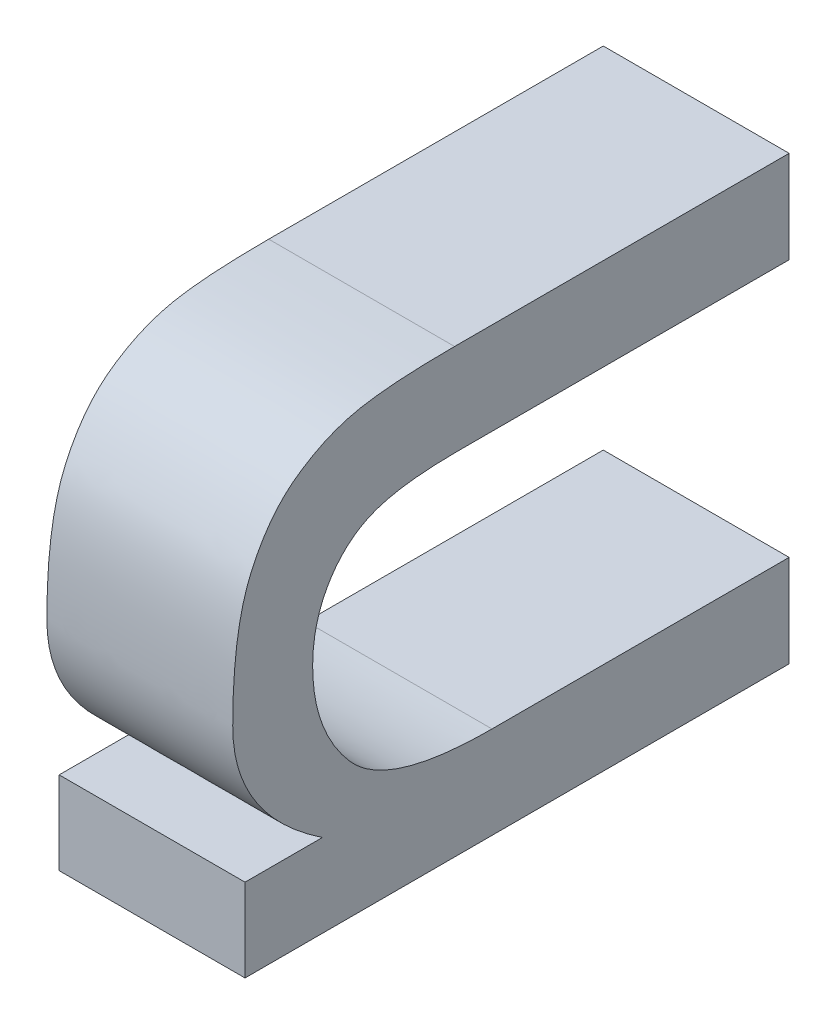
ISO-10303-21;
HEADER;
FILE_DESCRIPTION(('STEP AP214'),'2;1');
FILE_NAME('part.step','',(''),(''),'','','');
FILE_SCHEMA(('AUTOMOTIVE_DESIGN { 1 0 10303 214 1 1 1 1 }'));
ENDSEC;
DATA;
#1=APPLICATION_CONTEXT('core data for automotive mechanical design processes');
#2=APPLICATION_PROTOCOL_DEFINITION('international standard','automotive_design',2000,#1);
#3=PRODUCT_CONTEXT('',#1,'mechanical');
#4=PRODUCT('Part','Part','',(#3));
#5=PRODUCT_RELATED_PRODUCT_CATEGORY('part','',(#4));
#6=PRODUCT_DEFINITION_FORMATION('','',#4);
#7=PRODUCT_DEFINITION_CONTEXT('part definition',#1,'design');
#8=PRODUCT_DEFINITION('design','',#6,#7);
#9=PRODUCT_DEFINITION_SHAPE('','',#8);
#10=(LENGTH_UNIT() NAMED_UNIT(*) SI_UNIT(.MILLI.,.METRE.));
#11=(NAMED_UNIT(*) PLANE_ANGLE_UNIT() SI_UNIT($,.RADIAN.));
#12=(NAMED_UNIT(*) SI_UNIT($,.STERADIAN.) SOLID_ANGLE_UNIT());
#13=UNCERTAINTY_MEASURE_WITH_UNIT(LENGTH_MEASURE(1.E-05),#10,'distance_accuracy_value','');
#14=(GEOMETRIC_REPRESENTATION_CONTEXT(3) GLOBAL_UNCERTAINTY_ASSIGNED_CONTEXT((#13)) GLOBAL_UNIT_ASSIGNED_CONTEXT((#10,
#11,#12)) REPRESENTATION_CONTEXT('',''));
#15=CARTESIAN_POINT('',(0.,0.,0.));
#16=DIRECTION('',(0.,0.,1.));
#17=DIRECTION('',(1.,0.,0.));
#18=AXIS2_PLACEMENT_3D('',#15,#16,#17);
#19=CARTESIAN_POINT('',(4.55229940712901,-38.455317313085,-8.87538537038162));
#20=DIRECTION('',(-1.,0.,0.));
#21=DIRECTION('',(0.,0.,1.));
#22=AXIS2_PLACEMENT_3D('',#19,#20,#21);
#23=PLANE('',#22);
#24=CARTESIAN_POINT('',(4.552299407129,-38.3809253093449,-8.96104471327083));
#25=CARTESIAN_POINT('',(4.55229940712899,-38.3486738431566,-8.91280534076686));
#26=CARTESIAN_POINT('',(4.55229940712898,-38.2612916655351,-8.91280534076686));
#27=CARTESIAN_POINT('',(4.55229940712897,-38.2169114428315,-8.93182543621128));
#28=CARTESIAN_POINT('',(4.55229940712897,-38.1948591582582,-8.96269863461382));
#29=CARTESIAN_POINT('',(4.55229940712897,-38.1876921657719,-8.99770663637385));
#30=CARTESIAN_POINT('',(4.55229940712897,-38.1876921657719,-9.03216333101953));
#31=(BOUNDED_CURVE() B_SPLINE_CURVE(2,(#24,#25,#26,#27,#28,#29,#30),.UNSPECIFIED.,.F.,
.F.) B_SPLINE_CURVE_WITH_KNOTS((3,1,1,1,1,3),(16.6383776414451,17.6383776414451,
18.6383776414451,19.6383776414451,20.6383776414451,21.6383776414451),
.UNSPECIFIED.) CURVE() GEOMETRIC_REPRESENTATION_ITEM() RATIONAL_B_SPLINE_CURVE((1.,1.,1.,1.,1.,
1.,1.)) REPRESENTATION_ITEM(''));
#32=CARTESIAN_POINT('',(4.552299407129,-38.3809253093449,-8.96104471327083));
#33=VERTEX_POINT('',#32);
#34=CARTESIAN_POINT('',(4.55229940712897,-38.1876921657719,-9.03216333101953));
#35=VERTEX_POINT('',#34);
#36=EDGE_CURVE('E270',#33,#35,#31,.T.);
#37=ORIENTED_EDGE('',*,*,#36,.T.);
#38=CARTESIAN_POINT('',(4.55229940712897,-38.1876921657719,-9.03216333101953));
#39=CARTESIAN_POINT('',(4.55229940712897,-38.1876921657719,-9.12216421743409));
#40=CARTESIAN_POINT('',(4.55229940712897,-38.1876921657719,-9.21216510384864));
#41=(BOUNDED_CURVE() B_SPLINE_CURVE(2,(#38,#39,#40),.UNSPECIFIED.,.F.,
.F.) B_SPLINE_CURVE_WITH_KNOTS((3,3),(21.6383776414451,22.6383776414451),
.UNSPECIFIED.) CURVE() GEOMETRIC_REPRESENTATION_ITEM() RATIONAL_B_SPLINE_CURVE((1.,1.,1.)) REPRESENTATION_ITEM(''));
#42=CARTESIAN_POINT('',(4.55229940712897,-38.1876921657719,-9.21216510384864));
#43=VERTEX_POINT('',#42);
#44=EDGE_CURVE('E103',#35,#43,#41,.T.);
#45=ORIENTED_EDGE('',*,*,#44,.T.);
#46=CARTESIAN_POINT('',(4.55229940712897,-38.1876921657719,-9.21216510384864));
#47=CARTESIAN_POINT('',(4.55229940712898,-38.2125009859168,-9.21216510384864));
#48=CARTESIAN_POINT('',(4.55229940712898,-38.2373098060617,-9.21216510384864));
#49=(BOUNDED_CURVE() B_SPLINE_CURVE(2,(#46,#47,#48),.UNSPECIFIED.,.F.,
.F.) B_SPLINE_CURVE_WITH_KNOTS((3,3),(22.6383776414451,23.6383776414451),
.UNSPECIFIED.) CURVE() GEOMETRIC_REPRESENTATION_ITEM() RATIONAL_B_SPLINE_CURVE((1.,1.,1.)) REPRESENTATION_ITEM(''));
#50=CARTESIAN_POINT('',(4.55229940712898,-38.2373098060617,-9.21216510384864));
#51=VERTEX_POINT('',#50);
#52=EDGE_CURVE('E177',#43,#51,#49,.T.);
#53=ORIENTED_EDGE('',*,*,#52,.T.);
#54=CARTESIAN_POINT('',(4.55229940712898,-38.2373098060617,-9.21216510384864));
#55=CARTESIAN_POINT('',(4.55229940712898,-38.2373098060617,-9.12312900488417));
#56=CARTESIAN_POINT('',(4.55229940712898,-38.2373098060617,-9.0340929059197));
#57=(BOUNDED_CURVE() B_SPLINE_CURVE(2,(#54,#55,#56),.UNSPECIFIED.,.F.,
.F.) B_SPLINE_CURVE_WITH_KNOTS((3,3),(23.6383776414451,24.6383776414451),
.UNSPECIFIED.) CURVE() GEOMETRIC_REPRESENTATION_ITEM() RATIONAL_B_SPLINE_CURVE((1.,1.,1.)) REPRESENTATION_ITEM(''));
#58=CARTESIAN_POINT('',(4.55229940712898,-38.2373098060617,-9.0340929059197));
#59=VERTEX_POINT('',#58);
#60=EDGE_CURVE('E148',#51,#59,#57,.T.);
#61=ORIENTED_EDGE('',*,*,#60,.T.);
#62=CARTESIAN_POINT('',(4.55229940712898,-38.2373098060617,-9.0340929059197));
#63=CARTESIAN_POINT('',(4.55229940712898,-38.2373098060617,-9.00377101463148));
#64=CARTESIAN_POINT('',(4.55229940712898,-38.2430985307622,-8.98874789576596));
#65=CARTESIAN_POINT('',(4.55229940712898,-38.2488872554626,-8.97372477690045));
#66=CARTESIAN_POINT('',(4.55229940712898,-38.263634720771,-8.96476603629256));
#67=CARTESIAN_POINT('',(4.55229940712898,-38.2783821860794,-8.95580729568469));
#68=CARTESIAN_POINT('',(4.55229940712898,-38.2982292421953,-8.95580729568469));
#69=CARTESIAN_POINT('',(4.55229940712899,-38.3299294012693,-8.95580729568469));
#70=CARTESIAN_POINT('',(4.55229940712899,-38.3529464732926,-8.97593000535777));
#71=CARTESIAN_POINT('',(4.552299407129,-38.375963545316,-8.99605271503085));
#72=CARTESIAN_POINT('',(4.552299407129,-38.375963545316,-9.05228604069263));
#73=(BOUNDED_CURVE() B_SPLINE_CURVE(2,(#62,#63,#64,#65,#66,#67,#68,#69,#70,#71,#72),
.UNSPECIFIED.,.F.,.F.) B_SPLINE_CURVE_WITH_KNOTS((3,2,2,2,2,3),(24.6383776414451,
25.6383776414451,26.6383776414451,27.6383776414451,28.6383776414451,29.6383776414451),
.UNSPECIFIED.) CURVE() GEOMETRIC_REPRESENTATION_ITEM() RATIONAL_B_SPLINE_CURVE((1.,1.,1.,1.,1.,
1.,1.,1.,1.,1.,1.)) REPRESENTATION_ITEM(''));
#74=CARTESIAN_POINT('',(4.552299407129,-38.375963545316,-9.05228604069263));
#75=VERTEX_POINT('',#74);
#76=EDGE_CURVE('E145',#59,#75,#73,.T.);
#77=ORIENTED_EDGE('',*,*,#76,.T.);
#78=CARTESIAN_POINT('',(4.552299407129,-38.375963545316,-9.05228604069263));
#79=CARTESIAN_POINT('',(4.552299407129,-38.375963545316,-9.13222557227063));
#80=CARTESIAN_POINT('',(4.552299407129,-38.375963545316,-9.21216510384864));
#81=(BOUNDED_CURVE() B_SPLINE_CURVE(2,(#78,#79,#80),.UNSPECIFIED.,.F.,
.F.) B_SPLINE_CURVE_WITH_KNOTS((3,3),(29.6383776414451,30.6267893660532),
.UNSPECIFIED.) CURVE() GEOMETRIC_REPRESENTATION_ITEM() RATIONAL_B_SPLINE_CURVE((1.,1.,1.)) REPRESENTATION_ITEM(''));
#82=CARTESIAN_POINT('',(4.552299407129,-38.375963545316,-9.21216510384864));
#83=VERTEX_POINT('',#82);
#84=EDGE_CURVE('E131',#75,#83,#81,.T.);
#85=ORIENTED_EDGE('',*,*,#84,.T.);
#86=CARTESIAN_POINT('',(4.552299407129,-38.375963545316,-9.21216510384864));
#87=CARTESIAN_POINT('',(4.552299407129,-38.4007723654609,-9.21216510384864));
#88=CARTESIAN_POINT('',(4.55229940712901,-38.4255811856058,-9.21216510384864));
#89=(BOUNDED_CURVE() B_SPLINE_CURVE(2,(#86,#87,#88),.UNSPECIFIED.,.F.,
.F.) B_SPLINE_CURVE_WITH_KNOTS((3,3),(30.6267893660532,30.9335378323108),
.UNSPECIFIED.) CURVE() GEOMETRIC_REPRESENTATION_ITEM() RATIONAL_B_SPLINE_CURVE((1.,1.,1.)) REPRESENTATION_ITEM(''));
#90=CARTESIAN_POINT('',(4.55229940712901,-38.4255811856058,-9.21216510384864));
#91=VERTEX_POINT('',#90);
#92=EDGE_CURVE('E187',#83,#91,#89,.T.);
#93=ORIENTED_EDGE('',*,*,#92,.T.);
#94=CARTESIAN_POINT('',(4.55229940712901,-38.4255811856058,-9.21216510384864));
#95=CARTESIAN_POINT('',(4.552299407129,-38.4255811856058,-9.06579306499374));
#96=CARTESIAN_POINT('',(4.552299407129,-38.4255811856058,-8.91942102613884));
#97=(BOUNDED_CURVE() B_SPLINE_CURVE(2,(#94,#95,#96),.UNSPECIFIED.,.F.,
.F.) B_SPLINE_CURVE_WITH_KNOTS((3,3),(30.9335378323108,32.7433537832311),
.UNSPECIFIED.) CURVE() GEOMETRIC_REPRESENTATION_ITEM() RATIONAL_B_SPLINE_CURVE((1.,1.,1.)) REPRESENTATION_ITEM(''));
#98=CARTESIAN_POINT('',(4.552299407129,-38.4255811856058,-8.91942102613884));
#99=VERTEX_POINT('',#98);
#100=EDGE_CURVE('E300',#91,#99,#97,.T.);
#101=ORIENTED_EDGE('',*,*,#100,.T.);
#102=CARTESIAN_POINT('',(4.552299407129,-38.4255811856058,-8.91942102613884));
#103=CARTESIAN_POINT('',(4.552299407129,-38.4032532474753,-8.91942102613884));
#104=CARTESIAN_POINT('',(4.552299407129,-38.3809253093449,-8.91942102613884));
#105=(BOUNDED_CURVE() B_SPLINE_CURVE(2,(#102,#103,#104),.UNSPECIFIED.,.F.,
.F.) B_SPLINE_CURVE_WITH_KNOTS((3,3),(32.7433537832311,33.019427402863),
.UNSPECIFIED.) CURVE() GEOMETRIC_REPRESENTATION_ITEM() RATIONAL_B_SPLINE_CURVE((1.,1.,1.)) REPRESENTATION_ITEM(''));
#106=CARTESIAN_POINT('',(4.552299407129,-38.3809253093449,-8.91942102613884));
#107=VERTEX_POINT('',#106);
#108=EDGE_CURVE('E246',#99,#107,#105,.T.);
#109=ORIENTED_EDGE('',*,*,#108,.T.);
#110=CARTESIAN_POINT('',(4.552299407129,-38.3809253093449,-8.91942102613884));
#111=CARTESIAN_POINT('',(4.552299407129,-38.3809253093449,-8.94023286970483));
#112=CARTESIAN_POINT('',(4.552299407129,-38.3809253093449,-8.96104471327083));
#113=(BOUNDED_CURVE() B_SPLINE_CURVE(2,(#110,#111,#112),.UNSPECIFIED.,.F.,
.F.) B_SPLINE_CURVE_WITH_KNOTS((3,3),(33.019427402863,33.2767552828903),
.UNSPECIFIED.) CURVE() GEOMETRIC_REPRESENTATION_ITEM() RATIONAL_B_SPLINE_CURVE((1.,1.,1.)) REPRESENTATION_ITEM(''));
#114=EDGE_CURVE('E11',#107,#33,#113,.T.);
#115=ORIENTED_EDGE('',*,*,#114,.T.);
#116=EDGE_LOOP('',(#37,#45,#53,#61,#77,#85,#93,#101,#109,#115));
#117=FACE_BOUND('',#116,.T.);
#118=ADVANCED_FACE('F16',(#117),#23,.T.);
#119=CARTESIAN_POINT('',(4.65229940712901,-38.455317313085,-8.87538537038163));
#120=DIRECTION('',(1.,0.,0.));
#121=DIRECTION('',(0.,1.,0.));
#122=AXIS2_PLACEMENT_3D('',#119,#120,#121);
#123=PLANE('',#122);
#124=CARTESIAN_POINT('',(4.652299407129,-38.3809253093449,-8.91942102613884));
#125=CARTESIAN_POINT('',(4.652299407129,-38.3809253093449,-8.94023286970484));
#126=CARTESIAN_POINT('',(4.652299407129,-38.3809253093449,-8.96104471327083));
#127=(BOUNDED_CURVE() B_SPLINE_CURVE(2,(#124,#125,#126),.UNSPECIFIED.,.F.,
.F.) B_SPLINE_CURVE_WITH_KNOTS((3,3),(33.019427402863,33.2767552828903),
.UNSPECIFIED.) CURVE() GEOMETRIC_REPRESENTATION_ITEM() RATIONAL_B_SPLINE_CURVE((1.,1.,1.)) REPRESENTATION_ITEM(''));
#128=CARTESIAN_POINT('',(4.652299407129,-38.3809253093449,-8.91942102613884));
#129=VERTEX_POINT('',#128);
#130=CARTESIAN_POINT('',(4.652299407129,-38.3809253093449,-8.96104471327083));
#131=VERTEX_POINT('',#130);
#132=EDGE_CURVE('E31',#129,#131,#127,.T.);
#133=ORIENTED_EDGE('',*,*,#132,.F.);
#134=CARTESIAN_POINT('',(4.652299407129,-38.4255811856058,-8.91942102613884));
#135=CARTESIAN_POINT('',(4.652299407129,-38.4032532474753,-8.91942102613884));
#136=CARTESIAN_POINT('',(4.652299407129,-38.3809253093449,-8.91942102613884));
#137=(BOUNDED_CURVE() B_SPLINE_CURVE(2,(#134,#135,#136),.UNSPECIFIED.,.F.,
.F.) B_SPLINE_CURVE_WITH_KNOTS((3,3),(32.7433537832311,33.019427402863),
.UNSPECIFIED.) CURVE() GEOMETRIC_REPRESENTATION_ITEM() RATIONAL_B_SPLINE_CURVE((1.,1.,1.)) REPRESENTATION_ITEM(''));
#138=CARTESIAN_POINT('',(4.652299407129,-38.4255811856058,-8.91942102613884));
#139=VERTEX_POINT('',#138);
#140=EDGE_CURVE('E167',#139,#129,#137,.T.);
#141=ORIENTED_EDGE('',*,*,#140,.F.);
#142=CARTESIAN_POINT('',(4.65229940712901,-38.4255811856058,-9.21216510384864));
#143=CARTESIAN_POINT('',(4.65229940712901,-38.4255811856058,-9.06579306499374));
#144=CARTESIAN_POINT('',(4.652299407129,-38.4255811856058,-8.91942102613884));
#145=(BOUNDED_CURVE() B_SPLINE_CURVE(2,(#142,#143,#144),.UNSPECIFIED.,.F.,
.F.) B_SPLINE_CURVE_WITH_KNOTS((3,3),(30.9335378323108,32.7433537832311),
.UNSPECIFIED.) CURVE() GEOMETRIC_REPRESENTATION_ITEM() RATIONAL_B_SPLINE_CURVE((1.,1.,1.)) REPRESENTATION_ITEM(''));
#146=CARTESIAN_POINT('',(4.65229940712901,-38.4255811856058,-9.21216510384864));
#147=VERTEX_POINT('',#146);
#148=EDGE_CURVE('E195',#147,#139,#145,.T.);
#149=ORIENTED_EDGE('',*,*,#148,.F.);
#150=CARTESIAN_POINT('',(4.652299407129,-38.3759635453159,-9.21216510384864));
#151=CARTESIAN_POINT('',(4.652299407129,-38.4007723654609,-9.21216510384864));
#152=CARTESIAN_POINT('',(4.65229940712901,-38.4255811856058,-9.21216510384864));
#153=(BOUNDED_CURVE() B_SPLINE_CURVE(2,(#150,#151,#152),.UNSPECIFIED.,.F.,
.F.) B_SPLINE_CURVE_WITH_KNOTS((3,3),(30.6267893660532,30.9335378323108),
.UNSPECIFIED.) CURVE() GEOMETRIC_REPRESENTATION_ITEM() RATIONAL_B_SPLINE_CURVE((1.,1.,1.)) REPRESENTATION_ITEM(''));
#154=CARTESIAN_POINT('',(4.652299407129,-38.3759635453159,-9.21216510384864));
#155=VERTEX_POINT('',#154);
#156=EDGE_CURVE('E142',#155,#147,#153,.T.);
#157=ORIENTED_EDGE('',*,*,#156,.F.);
#158=CARTESIAN_POINT('',(4.652299407129,-38.375963545316,-9.05228604069263));
#159=CARTESIAN_POINT('',(4.652299407129,-38.375963545316,-9.13222557227063));
#160=CARTESIAN_POINT('',(4.652299407129,-38.3759635453159,-9.21216510384864));
#161=(BOUNDED_CURVE() B_SPLINE_CURVE(2,(#158,#159,#160),.UNSPECIFIED.,.F.,
.F.) B_SPLINE_CURVE_WITH_KNOTS((3,3),(29.6383776414451,30.6267893660532),
.UNSPECIFIED.) CURVE() GEOMETRIC_REPRESENTATION_ITEM() RATIONAL_B_SPLINE_CURVE((1.,1.,1.)) REPRESENTATION_ITEM(''));
#162=CARTESIAN_POINT('',(4.652299407129,-38.375963545316,-9.05228604069263));
#163=VERTEX_POINT('',#162);
#164=EDGE_CURVE('E123',#163,#155,#161,.T.);
#165=ORIENTED_EDGE('',*,*,#164,.F.);
#166=CARTESIAN_POINT('',(4.65229940712898,-38.2373098060617,-9.0340929059197));
#167=CARTESIAN_POINT('',(4.65229940712898,-38.2373098060617,-9.00377101463149));
#168=CARTESIAN_POINT('',(4.65229940712898,-38.2430985307621,-8.98874789576597));
#169=CARTESIAN_POINT('',(4.65229940712898,-38.2488872554626,-8.97372477690045));
#170=CARTESIAN_POINT('',(4.65229940712898,-38.263634720771,-8.96476603629257));
#171=CARTESIAN_POINT('',(4.65229940712898,-38.2783821860793,-8.95580729568469));
#172=CARTESIAN_POINT('',(4.65229940712899,-38.2982292421952,-8.95580729568469));
#173=CARTESIAN_POINT('',(4.65229940712899,-38.3299294012693,-8.95580729568469));
#174=CARTESIAN_POINT('',(4.65229940712899,-38.3529464732926,-8.97593000535777));
#175=CARTESIAN_POINT('',(4.652299407129,-38.375963545316,-8.99605271503085));
#176=CARTESIAN_POINT('',(4.652299407129,-38.375963545316,-9.05228604069263));
#177=(BOUNDED_CURVE() B_SPLINE_CURVE(2,(#166,#167,#168,#169,#170,#171,#172,#173,#174,#175,#176),
.UNSPECIFIED.,.F.,.F.) B_SPLINE_CURVE_WITH_KNOTS((3,2,2,2,2,3),(24.6383776414451,
25.6383776414451,26.6383776414451,27.6383776414451,28.6383776414451,29.6383776414451),
.UNSPECIFIED.) CURVE() GEOMETRIC_REPRESENTATION_ITEM() RATIONAL_B_SPLINE_CURVE((1.,1.,1.,1.,1.,
1.,1.,1.,1.,1.,1.)) REPRESENTATION_ITEM(''));
#178=CARTESIAN_POINT('',(4.65229940712898,-38.2373098060617,-9.0340929059197));
#179=VERTEX_POINT('',#178);
#180=EDGE_CURVE('E155',#179,#163,#177,.T.);
#181=ORIENTED_EDGE('',*,*,#180,.F.);
#182=CARTESIAN_POINT('',(4.65229940712898,-38.2373098060617,-9.21216510384864));
#183=CARTESIAN_POINT('',(4.65229940712898,-38.2373098060617,-9.12312900488417));
#184=CARTESIAN_POINT('',(4.65229940712898,-38.2373098060617,-9.0340929059197));
#185=(BOUNDED_CURVE() B_SPLINE_CURVE(2,(#182,#183,#184),.UNSPECIFIED.,.F.,
.F.) B_SPLINE_CURVE_WITH_KNOTS((3,3),(23.6383776414451,24.6383776414451),
.UNSPECIFIED.) CURVE() GEOMETRIC_REPRESENTATION_ITEM() RATIONAL_B_SPLINE_CURVE((1.,1.,1.)) REPRESENTATION_ITEM(''));
#186=CARTESIAN_POINT('',(4.65229940712898,-38.2373098060617,-9.21216510384864));
#187=VERTEX_POINT('',#186);
#188=EDGE_CURVE('E185',#187,#179,#185,.T.);
#189=ORIENTED_EDGE('',*,*,#188,.F.);
#190=CARTESIAN_POINT('',(4.65229940712897,-38.1876921657719,-9.21216510384864));
#191=CARTESIAN_POINT('',(4.65229940712898,-38.2125009859168,-9.21216510384864));
#192=CARTESIAN_POINT('',(4.65229940712898,-38.2373098060617,-9.21216510384864));
#193=(BOUNDED_CURVE() B_SPLINE_CURVE(2,(#190,#191,#192),.UNSPECIFIED.,.F.,
.F.) B_SPLINE_CURVE_WITH_KNOTS((3,3),(22.6383776414451,23.6383776414451),
.UNSPECIFIED.) CURVE() GEOMETRIC_REPRESENTATION_ITEM() RATIONAL_B_SPLINE_CURVE((1.,1.,1.)) REPRESENTATION_ITEM(''));
#194=CARTESIAN_POINT('',(4.65229940712897,-38.1876921657719,-9.21216510384864));
#195=VERTEX_POINT('',#194);
#196=EDGE_CURVE('E204',#195,#187,#193,.T.);
#197=ORIENTED_EDGE('',*,*,#196,.F.);
#198=CARTESIAN_POINT('',(4.65229940712897,-38.1876921657719,-9.03216333101954));
#199=CARTESIAN_POINT('',(4.65229940712897,-38.1876921657719,-9.12216421743409));
#200=CARTESIAN_POINT('',(4.65229940712897,-38.1876921657719,-9.21216510384864));
#201=(BOUNDED_CURVE() B_SPLINE_CURVE(2,(#198,#199,#200),.UNSPECIFIED.,.F.,
.F.) B_SPLINE_CURVE_WITH_KNOTS((3,3),(21.6383776414451,22.6383776414451),
.UNSPECIFIED.) CURVE() GEOMETRIC_REPRESENTATION_ITEM() RATIONAL_B_SPLINE_CURVE((1.,1.,1.)) REPRESENTATION_ITEM(''));
#202=CARTESIAN_POINT('',(4.65229940712897,-38.1876921657719,-9.03216333101954));
#203=VERTEX_POINT('',#202);
#204=EDGE_CURVE('E92',#203,#195,#201,.T.);
#205=ORIENTED_EDGE('',*,*,#204,.F.);
#206=CARTESIAN_POINT('',(4.652299407129,-38.3809253093449,-8.96104471327083));
#207=CARTESIAN_POINT('',(4.65229940712899,-38.3486738431565,-8.91280534076686));
#208=CARTESIAN_POINT('',(4.65229940712898,-38.2612916655351,-8.91280534076686));
#209=CARTESIAN_POINT('',(4.65229940712897,-38.2169114428314,-8.93182543621128));
#210=CARTESIAN_POINT('',(4.65229940712897,-38.1948591582582,-8.96269863461382));
#211=CARTESIAN_POINT('',(4.65229940712897,-38.1876921657719,-8.99770663637385));
#212=CARTESIAN_POINT('',(4.65229940712897,-38.1876921657719,-9.03216333101954));
#213=(BOUNDED_CURVE() B_SPLINE_CURVE(2,(#206,#207,#208,#209,#210,#211,#212),.UNSPECIFIED.,.F.,
.F.) B_SPLINE_CURVE_WITH_KNOTS((3,1,1,1,1,3),(16.6383776414451,17.6383776414451,
18.6383776414451,19.6383776414451,20.6383776414451,21.6383776414451),
.UNSPECIFIED.) CURVE() GEOMETRIC_REPRESENTATION_ITEM() RATIONAL_B_SPLINE_CURVE((1.,1.,1.,1.,1.,
1.,1.)) REPRESENTATION_ITEM(''));
#214=EDGE_CURVE('E206',#131,#203,#213,.T.);
#215=ORIENTED_EDGE('',*,*,#214,.F.);
#216=EDGE_LOOP('',(#133,#141,#149,#157,#165,#181,#189,#197,#205,#215));
#217=FACE_BOUND('',#216,.T.);
#218=ADVANCED_FACE('F391',(#217),#123,.T.);
#219=CARTESIAN_POINT('',(4.652299407129,-38.3809253093449,-8.91942102613884));
#220=CARTESIAN_POINT('',(4.552299407129,-38.3809253093449,-8.91942102613884));
#221=CARTESIAN_POINT('',(4.652299407129,-38.3809253093449,-8.94023286970484));
#222=CARTESIAN_POINT('',(4.552299407129,-38.3809253093449,-8.94023286970483));
#223=CARTESIAN_POINT('',(4.652299407129,-38.3809253093449,-8.96104471327083));
#224=CARTESIAN_POINT('',(4.552299407129,-38.3809253093449,-8.96104471327083));
#225=(BOUNDED_SURFACE() B_SPLINE_SURFACE(2,1,((#219,#220),(#221,#222),(#223,#224)),
.UNSPECIFIED.,.F.,.F.,.F.) B_SPLINE_SURFACE_WITH_KNOTS((3,3),(2,2),(33.019427402863,
33.2767552828903),(0.,0.1),
.UNSPECIFIED.) GEOMETRIC_REPRESENTATION_ITEM() RATIONAL_B_SPLINE_SURFACE(((1.,1.),(1.,1.),(1.,1.))) REPRESENTATION_ITEM('') SURFACE());
#226=CARTESIAN_POINT('',(4.652299407129,-38.3809253093449,-8.96104471327083));
#227=CARTESIAN_POINT('',(4.552299407129,-38.3809253093449,-8.96104471327083));
#228=(BOUNDED_CURVE() B_SPLINE_CURVE(1,(#226,#227),.UNSPECIFIED.,.F.,
.F.) B_SPLINE_CURVE_WITH_KNOTS((2,2),(0.,0.1),
.UNSPECIFIED.) CURVE() GEOMETRIC_REPRESENTATION_ITEM() RATIONAL_B_SPLINE_CURVE((1.,1.)) REPRESENTATION_ITEM(''));
#229=EDGE_CURVE('E262',#131,#33,#228,.T.);
#230=CARTESIAN_POINT('',(4.652299407129,-38.3809253093449,-8.91942102613884));
#231=CARTESIAN_POINT('',(4.552299407129,-38.3809253093449,-8.91942102613884));
#232=(BOUNDED_CURVE() B_SPLINE_CURVE(1,(#230,#231),.UNSPECIFIED.,.F.,
.F.) B_SPLINE_CURVE_WITH_KNOTS((2,2),(0.,0.1),
.UNSPECIFIED.) CURVE() GEOMETRIC_REPRESENTATION_ITEM() RATIONAL_B_SPLINE_CURVE((1.,1.)) REPRESENTATION_ITEM(''));
#233=EDGE_CURVE('E254',#129,#107,#232,.T.);
#234=ORIENTED_EDGE('',*,*,#132,.T.);
#235=ORIENTED_EDGE('',*,*,#229,.T.);
#236=ORIENTED_EDGE('',*,*,#114,.F.);
#237=ORIENTED_EDGE('',*,*,#233,.F.);
#238=EDGE_LOOP('',(#234,#235,#236,#237));
#239=FACE_BOUND('',#238,.T.);
#240=ADVANCED_FACE('F440',(#239),#225,.T.);
#241=CARTESIAN_POINT('',(4.652299407129,-38.4255811856058,-8.91942102613884));
#242=CARTESIAN_POINT('',(4.552299407129,-38.4255811856058,-8.91942102613884));
#243=CARTESIAN_POINT('',(4.652299407129,-38.4032532474753,-8.91942102613884));
#244=CARTESIAN_POINT('',(4.552299407129,-38.4032532474753,-8.91942102613884));
#245=CARTESIAN_POINT('',(4.652299407129,-38.3809253093449,-8.91942102613884));
#246=CARTESIAN_POINT('',(4.552299407129,-38.3809253093449,-8.91942102613884));
#247=(BOUNDED_SURFACE() B_SPLINE_SURFACE(2,1,((#241,#242),(#243,#244),(#245,#246)),
.UNSPECIFIED.,.F.,.F.,.F.) B_SPLINE_SURFACE_WITH_KNOTS((3,3),(2,2),(32.7433537832311,
33.019427402863),(0.,0.1),
.UNSPECIFIED.) GEOMETRIC_REPRESENTATION_ITEM() RATIONAL_B_SPLINE_SURFACE(((1.,1.),(1.,1.),(1.,1.))) REPRESENTATION_ITEM('') SURFACE());
#248=CARTESIAN_POINT('',(4.652299407129,-38.4255811856058,-8.91942102613884));
#249=CARTESIAN_POINT('',(4.552299407129,-38.4255811856058,-8.91942102613884));
#250=(BOUNDED_CURVE() B_SPLINE_CURVE(1,(#248,#249),.UNSPECIFIED.,.F.,
.F.) B_SPLINE_CURVE_WITH_KNOTS((2,2),(0.,0.1),
.UNSPECIFIED.) CURVE() GEOMETRIC_REPRESENTATION_ITEM() RATIONAL_B_SPLINE_CURVE((1.,1.)) REPRESENTATION_ITEM(''));
#251=EDGE_CURVE('E308',#139,#99,#250,.T.);
#252=ORIENTED_EDGE('',*,*,#140,.T.);
#253=ORIENTED_EDGE('',*,*,#233,.T.);
#254=ORIENTED_EDGE('',*,*,#108,.F.);
#255=ORIENTED_EDGE('',*,*,#251,.F.);
#256=EDGE_LOOP('',(#252,#253,#254,#255));
#257=FACE_BOUND('',#256,.T.);
#258=ADVANCED_FACE('F390',(#257),#247,.T.);
#259=CARTESIAN_POINT('',(4.65229940712901,-38.4255811856058,-9.21216510384864));
#260=CARTESIAN_POINT('',(4.55229940712901,-38.4255811856058,-9.21216510384864));
#261=CARTESIAN_POINT('',(4.65229940712901,-38.4255811856058,-9.06579306499374));
#262=CARTESIAN_POINT('',(4.552299407129,-38.4255811856058,-9.06579306499374));
#263=CARTESIAN_POINT('',(4.652299407129,-38.4255811856058,-8.91942102613884));
#264=CARTESIAN_POINT('',(4.552299407129,-38.4255811856058,-8.91942102613884));
#265=(BOUNDED_SURFACE() B_SPLINE_SURFACE(2,1,((#259,#260),(#261,#262),(#263,#264)),
.UNSPECIFIED.,.F.,.F.,.F.) B_SPLINE_SURFACE_WITH_KNOTS((3,3),(2,2),(30.9335378323108,
32.7433537832311),(0.,0.1),
.UNSPECIFIED.) GEOMETRIC_REPRESENTATION_ITEM() RATIONAL_B_SPLINE_SURFACE(((1.,1.),(1.,1.),(1.,1.))) REPRESENTATION_ITEM('') SURFACE());
#266=CARTESIAN_POINT('',(4.65229940712901,-38.4255811856058,-9.21216510384864));
#267=CARTESIAN_POINT('',(4.55229940712901,-38.4255811856058,-9.21216510384864));
#268=(BOUNDED_CURVE() B_SPLINE_CURVE(1,(#266,#267),.UNSPECIFIED.,.F.,
.F.) B_SPLINE_CURVE_WITH_KNOTS((2,2),(0.,0.1),
.UNSPECIFIED.) CURVE() GEOMETRIC_REPRESENTATION_ITEM() RATIONAL_B_SPLINE_CURVE((1.,1.)) REPRESENTATION_ITEM(''));
#269=EDGE_CURVE('E196',#147,#91,#268,.T.);
#270=ORIENTED_EDGE('',*,*,#148,.T.);
#271=ORIENTED_EDGE('',*,*,#251,.T.);
#272=ORIENTED_EDGE('',*,*,#100,.F.);
#273=ORIENTED_EDGE('',*,*,#269,.F.);
#274=EDGE_LOOP('',(#270,#271,#272,#273));
#275=FACE_BOUND('',#274,.T.);
#276=ADVANCED_FACE('F447',(#275),#265,.T.);
#277=CARTESIAN_POINT('',(4.652299407129,-38.3759635453159,-9.21216510384864));
#278=CARTESIAN_POINT('',(4.552299407129,-38.375963545316,-9.21216510384864));
#279=CARTESIAN_POINT('',(4.652299407129,-38.4007723654609,-9.21216510384864));
#280=CARTESIAN_POINT('',(4.552299407129,-38.4007723654609,-9.21216510384864));
#281=CARTESIAN_POINT('',(4.65229940712901,-38.4255811856058,-9.21216510384864));
#282=CARTESIAN_POINT('',(4.55229940712901,-38.4255811856058,-9.21216510384864));
#283=(BOUNDED_SURFACE() B_SPLINE_SURFACE(2,1,((#277,#278),(#279,#280),(#281,#282)),
.UNSPECIFIED.,.F.,.F.,.F.) B_SPLINE_SURFACE_WITH_KNOTS((3,3),(2,2),(30.6267893660532,
30.9335378323108),(0.,0.1),
.UNSPECIFIED.) GEOMETRIC_REPRESENTATION_ITEM() RATIONAL_B_SPLINE_SURFACE(((1.,1.),(1.,1.),(1.,1.))) REPRESENTATION_ITEM('') SURFACE());
#284=CARTESIAN_POINT('',(4.652299407129,-38.3759635453159,-9.21216510384864));
#285=CARTESIAN_POINT('',(4.552299407129,-38.375963545316,-9.21216510384864));
#286=(BOUNDED_CURVE() B_SPLINE_CURVE(1,(#284,#285),.UNSPECIFIED.,.F.,
.F.) B_SPLINE_CURVE_WITH_KNOTS((2,2),(0.,0.1),
.UNSPECIFIED.) CURVE() GEOMETRIC_REPRESENTATION_ITEM() RATIONAL_B_SPLINE_CURVE((1.,1.)) REPRESENTATION_ITEM(''));
#287=EDGE_CURVE('E138',#155,#83,#286,.T.);
#288=ORIENTED_EDGE('',*,*,#156,.T.);
#289=ORIENTED_EDGE('',*,*,#269,.T.);
#290=ORIENTED_EDGE('',*,*,#92,.F.);
#291=ORIENTED_EDGE('',*,*,#287,.F.);
#292=EDGE_LOOP('',(#288,#289,#290,#291));
#293=FACE_BOUND('',#292,.T.);
#294=ADVANCED_FACE('F18',(#293),#283,.T.);
#295=CARTESIAN_POINT('',(4.652299407129,-38.375963545316,-9.05228604069263));
#296=CARTESIAN_POINT('',(4.552299407129,-38.375963545316,-9.05228604069263));
#297=CARTESIAN_POINT('',(4.652299407129,-38.375963545316,-9.13222557227063));
#298=CARTESIAN_POINT('',(4.552299407129,-38.375963545316,-9.13222557227063));
#299=CARTESIAN_POINT('',(4.652299407129,-38.3759635453159,-9.21216510384864));
#300=CARTESIAN_POINT('',(4.552299407129,-38.375963545316,-9.21216510384864));
#301=(BOUNDED_SURFACE() B_SPLINE_SURFACE(2,1,((#295,#296),(#297,#298),(#299,#300)),
.UNSPECIFIED.,.F.,.F.,.F.) B_SPLINE_SURFACE_WITH_KNOTS((3,3),(2,2),(29.6383776414451,
30.6267893660532),(0.,0.1),
.UNSPECIFIED.) GEOMETRIC_REPRESENTATION_ITEM() RATIONAL_B_SPLINE_SURFACE(((1.,1.),(1.,1.),(1.,1.))) REPRESENTATION_ITEM('') SURFACE());
#302=CARTESIAN_POINT('',(4.652299407129,-38.375963545316,-9.05228604069263));
#303=CARTESIAN_POINT('',(4.552299407129,-38.375963545316,-9.05228604069263));
#304=(BOUNDED_CURVE() B_SPLINE_CURVE(1,(#302,#303),.UNSPECIFIED.,.F.,
.F.) B_SPLINE_CURVE_WITH_KNOTS((2,2),(0.,0.1),
.UNSPECIFIED.) CURVE() GEOMETRIC_REPRESENTATION_ITEM() RATIONAL_B_SPLINE_CURVE((1.,1.)) REPRESENTATION_ITEM(''));
#305=EDGE_CURVE('E135',#163,#75,#304,.T.);
#306=ORIENTED_EDGE('',*,*,#164,.T.);
#307=ORIENTED_EDGE('',*,*,#287,.T.);
#308=ORIENTED_EDGE('',*,*,#84,.F.);
#309=ORIENTED_EDGE('',*,*,#305,.F.);
#310=EDGE_LOOP('',(#306,#307,#308,#309));
#311=FACE_BOUND('',#310,.T.);
#312=ADVANCED_FACE('F133',(#311),#301,.T.);
#313=CARTESIAN_POINT('',(4.65229940712898,-38.2373098060617,-9.0340929059197));
#314=CARTESIAN_POINT('',(4.55229940712898,-38.2373098060617,-9.0340929059197));
#315=CARTESIAN_POINT('',(4.65229940712898,-38.2373098060617,-9.00377101463149));
#316=CARTESIAN_POINT('',(4.55229940712898,-38.2373098060617,-9.00377101463148));
#317=CARTESIAN_POINT('',(4.65229940712898,-38.2430985307621,-8.98874789576597));
#318=CARTESIAN_POINT('',(4.55229940712898,-38.2430985307622,-8.98874789576596));
#319=CARTESIAN_POINT('',(4.65229940712898,-38.2488872554626,-8.97372477690045));
#320=CARTESIAN_POINT('',(4.55229940712898,-38.2488872554626,-8.97372477690045));
#321=CARTESIAN_POINT('',(4.65229940712898,-38.263634720771,-8.96476603629257));
#322=CARTESIAN_POINT('',(4.55229940712898,-38.263634720771,-8.96476603629256));
#323=CARTESIAN_POINT('',(4.65229940712898,-38.2783821860793,-8.95580729568469));
#324=CARTESIAN_POINT('',(4.55229940712898,-38.2783821860794,-8.95580729568469));
#325=CARTESIAN_POINT('',(4.65229940712899,-38.2982292421952,-8.95580729568469));
#326=CARTESIAN_POINT('',(4.55229940712898,-38.2982292421953,-8.95580729568469));
#327=CARTESIAN_POINT('',(4.65229940712899,-38.3299294012693,-8.95580729568469));
#328=CARTESIAN_POINT('',(4.55229940712899,-38.3299294012693,-8.95580729568469));
#329=CARTESIAN_POINT('',(4.65229940712899,-38.3529464732926,-8.97593000535777));
#330=CARTESIAN_POINT('',(4.55229940712899,-38.3529464732926,-8.97593000535777));
#331=CARTESIAN_POINT('',(4.652299407129,-38.375963545316,-8.99605271503085));
#332=CARTESIAN_POINT('',(4.552299407129,-38.375963545316,-8.99605271503085));
#333=CARTESIAN_POINT('',(4.652299407129,-38.375963545316,-9.05228604069263));
#334=CARTESIAN_POINT('',(4.552299407129,-38.375963545316,-9.05228604069263));
#335=(BOUNDED_SURFACE() B_SPLINE_SURFACE(2,1,((#313,#314),(#315,#316),(#317,#318),(#319,#320),
(#321,#322),(#323,#324),(#325,#326),(#327,#328),(#329,#330),(#331,#332),(#333,#334)),
.UNSPECIFIED.,.F.,.F.,.F.) B_SPLINE_SURFACE_WITH_KNOTS((3,2,2,2,2,3),(2,2),(24.6383776414451,
25.6383776414451,26.6383776414451,27.6383776414451,28.6383776414451,29.6383776414451),(0.,0.1),
.UNSPECIFIED.) GEOMETRIC_REPRESENTATION_ITEM() RATIONAL_B_SPLINE_SURFACE(((1.,1.),(1.,1.),(1.,
1.),(1.,1.),(1.,1.),(1.,1.),(1.,1.),(1.,1.),(1.,1.),(1.,1.),(1.,1.))) REPRESENTATION_ITEM('') SURFACE());
#336=CARTESIAN_POINT('',(4.65229940712898,-38.2373098060617,-9.0340929059197));
#337=CARTESIAN_POINT('',(4.55229940712898,-38.2373098060617,-9.0340929059197));
#338=(BOUNDED_CURVE() B_SPLINE_CURVE(1,(#336,#337),.UNSPECIFIED.,.F.,
.F.) B_SPLINE_CURVE_WITH_KNOTS((2,2),(0.,0.1),
.UNSPECIFIED.) CURVE() GEOMETRIC_REPRESENTATION_ITEM() RATIONAL_B_SPLINE_CURVE((1.,1.)) REPRESENTATION_ITEM(''));
#339=EDGE_CURVE('E239',#179,#59,#338,.T.);
#340=ORIENTED_EDGE('',*,*,#180,.T.);
#341=ORIENTED_EDGE('',*,*,#305,.T.);
#342=ORIENTED_EDGE('',*,*,#76,.F.);
#343=ORIENTED_EDGE('',*,*,#339,.F.);
#344=EDGE_LOOP('',(#340,#341,#342,#343));
#345=FACE_BOUND('',#344,.T.);
#346=ADVANCED_FACE('F154',(#345),#335,.T.);
#347=CARTESIAN_POINT('',(4.65229940712898,-38.2373098060617,-9.21216510384864));
#348=CARTESIAN_POINT('',(4.55229940712898,-38.2373098060617,-9.21216510384864));
#349=CARTESIAN_POINT('',(4.65229940712898,-38.2373098060617,-9.12312900488417));
#350=CARTESIAN_POINT('',(4.55229940712898,-38.2373098060617,-9.12312900488417));
#351=CARTESIAN_POINT('',(4.65229940712898,-38.2373098060617,-9.0340929059197));
#352=CARTESIAN_POINT('',(4.55229940712898,-38.2373098060617,-9.0340929059197));
#353=(BOUNDED_SURFACE() B_SPLINE_SURFACE(2,1,((#347,#348),(#349,#350),(#351,#352)),
.UNSPECIFIED.,.F.,.F.,.F.) B_SPLINE_SURFACE_WITH_KNOTS((3,3),(2,2),(23.6383776414451,
24.6383776414451),(0.,0.1),
.UNSPECIFIED.) GEOMETRIC_REPRESENTATION_ITEM() RATIONAL_B_SPLINE_SURFACE(((1.,1.),(1.,1.),(1.,1.))) REPRESENTATION_ITEM('') SURFACE());
#354=CARTESIAN_POINT('',(4.65229940712898,-38.2373098060617,-9.21216510384864));
#355=CARTESIAN_POINT('',(4.55229940712898,-38.2373098060617,-9.21216510384864));
#356=(BOUNDED_CURVE() B_SPLINE_CURVE(1,(#354,#355),.UNSPECIFIED.,.F.,
.F.) B_SPLINE_CURVE_WITH_KNOTS((2,2),(0.,0.1),
.UNSPECIFIED.) CURVE() GEOMETRIC_REPRESENTATION_ITEM() RATIONAL_B_SPLINE_CURVE((1.,1.)) REPRESENTATION_ITEM(''));
#357=EDGE_CURVE('E186',#187,#51,#356,.T.);
#358=ORIENTED_EDGE('',*,*,#188,.T.);
#359=ORIENTED_EDGE('',*,*,#339,.T.);
#360=ORIENTED_EDGE('',*,*,#60,.F.);
#361=ORIENTED_EDGE('',*,*,#357,.F.);
#362=EDGE_LOOP('',(#358,#359,#360,#361));
#363=FACE_BOUND('',#362,.T.);
#364=ADVANCED_FACE('F476',(#363),#353,.T.);
#365=CARTESIAN_POINT('',(4.65229940712897,-38.1876921657719,-9.21216510384864));
#366=CARTESIAN_POINT('',(4.55229940712897,-38.1876921657719,-9.21216510384864));
#367=CARTESIAN_POINT('',(4.65229940712898,-38.2125009859168,-9.21216510384864));
#368=CARTESIAN_POINT('',(4.55229940712898,-38.2125009859168,-9.21216510384864));
#369=CARTESIAN_POINT('',(4.65229940712898,-38.2373098060617,-9.21216510384864));
#370=CARTESIAN_POINT('',(4.55229940712898,-38.2373098060617,-9.21216510384864));
#371=(BOUNDED_SURFACE() B_SPLINE_SURFACE(2,1,((#365,#366),(#367,#368),(#369,#370)),
.UNSPECIFIED.,.F.,.F.,.F.) B_SPLINE_SURFACE_WITH_KNOTS((3,3),(2,2),(22.6383776414451,
23.6383776414451),(0.,0.1),
.UNSPECIFIED.) GEOMETRIC_REPRESENTATION_ITEM() RATIONAL_B_SPLINE_SURFACE(((1.,1.),(1.,1.),(1.,1.))) REPRESENTATION_ITEM('') SURFACE());
#372=CARTESIAN_POINT('',(4.65229940712897,-38.1876921657719,-9.21216510384864));
#373=CARTESIAN_POINT('',(4.55229940712897,-38.1876921657719,-9.21216510384864));
#374=(BOUNDED_CURVE() B_SPLINE_CURVE(1,(#372,#373),.UNSPECIFIED.,.F.,
.F.) B_SPLINE_CURVE_WITH_KNOTS((2,2),(0.,0.1),
.UNSPECIFIED.) CURVE() GEOMETRIC_REPRESENTATION_ITEM() RATIONAL_B_SPLINE_CURVE((1.,1.)) REPRESENTATION_ITEM(''));
#375=EDGE_CURVE('E205',#195,#43,#374,.T.);
#376=ORIENTED_EDGE('',*,*,#196,.T.);
#377=ORIENTED_EDGE('',*,*,#357,.T.);
#378=ORIENTED_EDGE('',*,*,#52,.F.);
#379=ORIENTED_EDGE('',*,*,#375,.F.);
#380=EDGE_LOOP('',(#376,#377,#378,#379));
#381=FACE_BOUND('',#380,.T.);
#382=ADVANCED_FACE('F464',(#381),#371,.T.);
#383=CARTESIAN_POINT('',(4.65229940712897,-38.1876921657719,-9.03216333101954));
#384=CARTESIAN_POINT('',(4.55229940712897,-38.1876921657719,-9.03216333101953));
#385=CARTESIAN_POINT('',(4.65229940712897,-38.1876921657719,-9.12216421743409));
#386=CARTESIAN_POINT('',(4.55229940712897,-38.1876921657719,-9.12216421743409));
#387=CARTESIAN_POINT('',(4.65229940712897,-38.1876921657719,-9.21216510384864));
#388=CARTESIAN_POINT('',(4.55229940712897,-38.1876921657719,-9.21216510384864));
#389=(BOUNDED_SURFACE() B_SPLINE_SURFACE(2,1,((#383,#384),(#385,#386),(#387,#388)),
.UNSPECIFIED.,.F.,.F.,.F.) B_SPLINE_SURFACE_WITH_KNOTS((3,3),(2,2),(21.6383776414451,
22.6383776414451),(0.,0.1),
.UNSPECIFIED.) GEOMETRIC_REPRESENTATION_ITEM() RATIONAL_B_SPLINE_SURFACE(((1.,1.),(1.,1.),(1.,1.))) REPRESENTATION_ITEM('') SURFACE());
#390=CARTESIAN_POINT('',(4.65229940712897,-38.1876921657719,-9.03216333101954));
#391=CARTESIAN_POINT('',(4.55229940712897,-38.1876921657719,-9.03216333101953));
#392=(BOUNDED_CURVE() B_SPLINE_CURVE(1,(#390,#391),.UNSPECIFIED.,.F.,
.F.) B_SPLINE_CURVE_WITH_KNOTS((2,2),(0.,0.1),
.UNSPECIFIED.) CURVE() GEOMETRIC_REPRESENTATION_ITEM() RATIONAL_B_SPLINE_CURVE((1.,1.)) REPRESENTATION_ITEM(''));
#393=EDGE_CURVE('E22',#203,#35,#392,.T.);
#394=ORIENTED_EDGE('',*,*,#204,.T.);
#395=ORIENTED_EDGE('',*,*,#375,.T.);
#396=ORIENTED_EDGE('',*,*,#44,.F.);
#397=ORIENTED_EDGE('',*,*,#393,.F.);
#398=EDGE_LOOP('',(#394,#395,#396,#397));
#399=FACE_BOUND('',#398,.T.);
#400=ADVANCED_FACE('F459',(#399),#389,.T.);
#401=CARTESIAN_POINT('',(4.652299407129,-38.3809253093449,-8.96104471327083));
#402=CARTESIAN_POINT('',(4.552299407129,-38.3809253093449,-8.96104471327083));
#403=CARTESIAN_POINT('',(4.65229940712899,-38.3486738431565,-8.91280534076686));
#404=CARTESIAN_POINT('',(4.55229940712899,-38.3486738431566,-8.91280534076686));
#405=CARTESIAN_POINT('',(4.65229940712898,-38.2612916655351,-8.91280534076686));
#406=CARTESIAN_POINT('',(4.55229940712898,-38.2612916655351,-8.91280534076686));
#407=CARTESIAN_POINT('',(4.65229940712897,-38.2169114428314,-8.93182543621128));
#408=CARTESIAN_POINT('',(4.55229940712897,-38.2169114428315,-8.93182543621128));
#409=CARTESIAN_POINT('',(4.65229940712897,-38.1948591582582,-8.96269863461382));
#410=CARTESIAN_POINT('',(4.55229940712897,-38.1948591582582,-8.96269863461382));
#411=CARTESIAN_POINT('',(4.65229940712897,-38.1876921657719,-8.99770663637385));
#412=CARTESIAN_POINT('',(4.55229940712897,-38.1876921657719,-8.99770663637385));
#413=CARTESIAN_POINT('',(4.65229940712897,-38.1876921657719,-9.03216333101954));
#414=CARTESIAN_POINT('',(4.55229940712897,-38.1876921657719,-9.03216333101953));
#415=(BOUNDED_SURFACE() B_SPLINE_SURFACE(2,1,((#401,#402),(#403,#404),(#405,#406),(#407,#408),
(#409,#410),(#411,#412),(#413,#414)),.UNSPECIFIED.,.F.,.F.,.F.) B_SPLINE_SURFACE_WITH_KNOTS((3,
1,1,1,1,3),(2,2),(16.6383776414451,17.6383776414451,18.6383776414451,19.6383776414451,
20.6383776414451,21.6383776414451),(0.,0.1),
.UNSPECIFIED.) GEOMETRIC_REPRESENTATION_ITEM() RATIONAL_B_SPLINE_SURFACE(((1.,1.),(1.,1.),(1.,
1.),(1.,1.),(1.,1.),(1.,1.),(1.,1.))) REPRESENTATION_ITEM('') SURFACE());
#416=ORIENTED_EDGE('',*,*,#214,.T.);
#417=ORIENTED_EDGE('',*,*,#393,.T.);
#418=ORIENTED_EDGE('',*,*,#36,.F.);
#419=ORIENTED_EDGE('',*,*,#229,.F.);
#420=EDGE_LOOP('',(#416,#417,#418,#419));
#421=FACE_BOUND('',#420,.T.);
#422=ADVANCED_FACE('F463',(#421),#415,.T.);
#423=CLOSED_SHELL('',(#118,#218,#240,#258,#276,#294,#312,#346,#364,#382,#400,#422));
#424=MANIFOLD_SOLID_BREP('B1',#423);
#425=ADVANCED_BREP_SHAPE_REPRESENTATION('',(#18,#424),#14);
#426=SHAPE_DEFINITION_REPRESENTATION(#9,#425);
ENDSEC;
END-ISO-10303-21;
